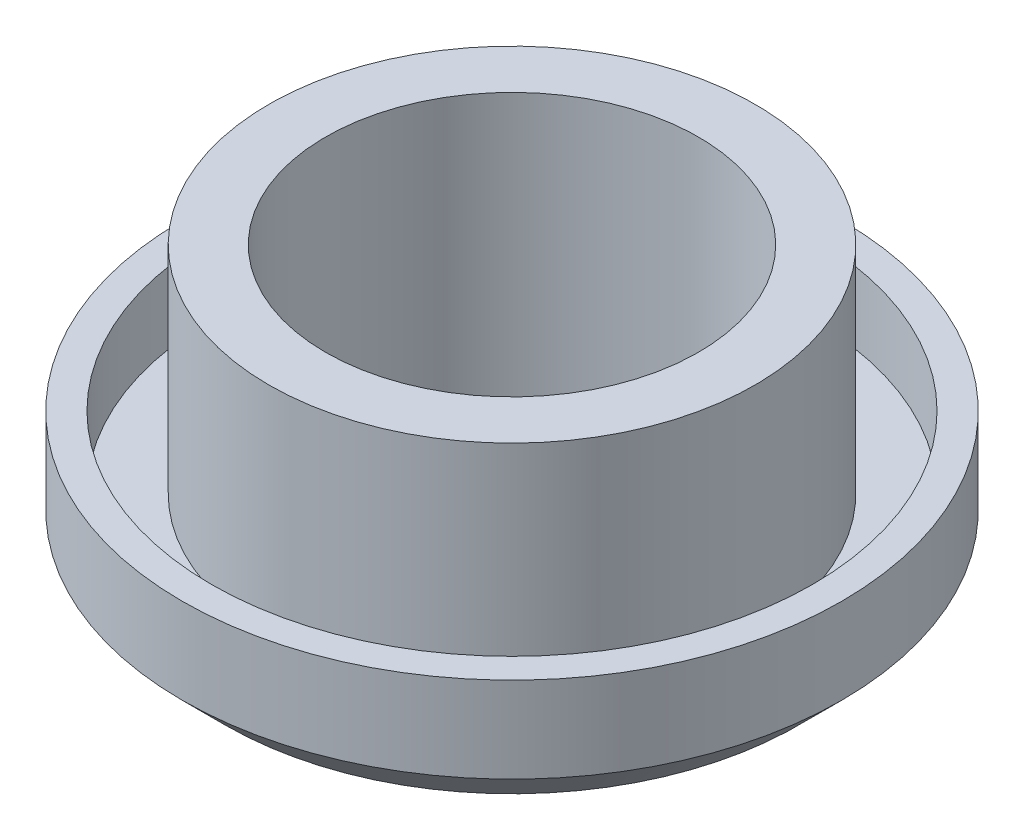
ISO-10303-21;
HEADER;
FILE_DESCRIPTION(('STEP AP214'),'2;1');
FILE_NAME('part.step','',(''),(''),'','','');
FILE_SCHEMA(('AUTOMOTIVE_DESIGN { 1 0 10303 214 1 1 1 1 }'));
ENDSEC;
DATA;
#1=APPLICATION_CONTEXT('core data for automotive mechanical design processes');
#2=APPLICATION_PROTOCOL_DEFINITION('international standard','automotive_design',2000,#1);
#3=PRODUCT_CONTEXT('',#1,'mechanical');
#4=PRODUCT('Part','Part','',(#3));
#5=PRODUCT_RELATED_PRODUCT_CATEGORY('part','',(#4));
#6=PRODUCT_DEFINITION_FORMATION('','',#4);
#7=PRODUCT_DEFINITION_CONTEXT('part definition',#1,'design');
#8=PRODUCT_DEFINITION('design','',#6,#7);
#9=PRODUCT_DEFINITION_SHAPE('','',#8);
#10=(LENGTH_UNIT() NAMED_UNIT(*) SI_UNIT(.MILLI.,.METRE.));
#11=(NAMED_UNIT(*) PLANE_ANGLE_UNIT() SI_UNIT($,.RADIAN.));
#12=(NAMED_UNIT(*) SI_UNIT($,.STERADIAN.) SOLID_ANGLE_UNIT());
#13=UNCERTAINTY_MEASURE_WITH_UNIT(LENGTH_MEASURE(1.E-05),#10,'distance_accuracy_value','');
#14=(GEOMETRIC_REPRESENTATION_CONTEXT(3) GLOBAL_UNCERTAINTY_ASSIGNED_CONTEXT((#13)) GLOBAL_UNIT_ASSIGNED_CONTEXT((#10,
#11,#12)) REPRESENTATION_CONTEXT('',''));
#15=CARTESIAN_POINT('',(0.,0.,0.));
#16=DIRECTION('',(0.,0.,1.));
#17=DIRECTION('',(1.,0.,0.));
#18=AXIS2_PLACEMENT_3D('',#15,#16,#17);
#19=CARTESIAN_POINT('',(0.,17.3,0.));
#20=DIRECTION('',(0.,-1.,0.));
#21=DIRECTION('',(0.,0.,-1.));
#22=AXIS2_PLACEMENT_3D('',#19,#20,#21);
#23=PLANE('',#22);
#24=CARTESIAN_POINT('',(17.6027715398199,17.3,0.));
#25=DIRECTION('',(0.,1.,0.));
#26=DIRECTION('',(0.,0.,1.));
#27=AXIS2_PLACEMENT_3D('',#24,#25,#26);
#28=CIRCLE('',#27,22.4);
#29=CARTESIAN_POINT('',(17.6027715398199,17.3,22.4));
#30=VERTEX_POINT('',#29);
#31=EDGE_CURVE('E79',#30,#30,#28,.T.);
#32=ORIENTED_EDGE('',*,*,#31,.F.);
#33=EDGE_LOOP('',(#32));
#34=FACE_BOUND('',#33,.T.);
#35=CARTESIAN_POINT('',(17.6027715398199,17.3,0.));
#36=DIRECTION('',(0.,1.,0.));
#37=DIRECTION('',(0.,0.,1.));
#38=AXIS2_PLACEMENT_3D('',#35,#36,#37);
#39=CIRCLE('',#38,29.2);
#40=CARTESIAN_POINT('',(17.6027715398199,17.3,29.2));
#41=VERTEX_POINT('',#40);
#42=EDGE_CURVE('E52',#41,#41,#39,.T.);
#43=ORIENTED_EDGE('',*,*,#42,.T.);
#44=EDGE_LOOP('',(#43));
#45=FACE_BOUND('',#44,.T.);
#46=ADVANCED_FACE('F39',(#34,#45),#23,.F.);
#47=CARTESIAN_POINT('',(17.6027715398199,25.4720277784783,0.));
#48=DIRECTION('',(0.,1.,0.));
#49=DIRECTION('',(0.,0.,1.));
#50=AXIS2_PLACEMENT_3D('',#47,#48,#49);
#51=CYLINDRICAL_SURFACE('',#50,29.2);
#52=ORIENTED_EDGE('',*,*,#42,.F.);
#53=EDGE_LOOP('',(#52));
#54=FACE_BOUND('',#53,.T.);
#55=CARTESIAN_POINT('',(17.6027715398199,-8.6,0.));
#56=DIRECTION('',(0.,1.,0.));
#57=DIRECTION('',(0.,0.,1.));
#58=AXIS2_PLACEMENT_3D('',#55,#56,#57);
#59=CIRCLE('',#58,29.2);
#60=CARTESIAN_POINT('',(17.6027715398199,-8.6,29.2));
#61=VERTEX_POINT('',#60);
#62=EDGE_CURVE('E57',#61,#61,#59,.T.);
#63=ORIENTED_EDGE('',*,*,#62,.T.);
#64=EDGE_LOOP('',(#63));
#65=FACE_BOUND('',#64,.T.);
#66=ADVANCED_FACE('F88',(#54,#65),#51,.T.);
#67=CARTESIAN_POINT('',(0.,-8.6,0.));
#68=DIRECTION('',(0.,-1.,0.));
#69=DIRECTION('',(0.,0.,-1.));
#70=AXIS2_PLACEMENT_3D('',#67,#68,#69);
#71=PLANE('',#70);
#72=ORIENTED_EDGE('',*,*,#62,.F.);
#73=EDGE_LOOP('',(#72));
#74=FACE_BOUND('',#73,.T.);
#75=CARTESIAN_POINT('',(17.6027715398199,-8.6,0.));
#76=DIRECTION('',(0.,1.,0.));
#77=DIRECTION('',(0.,0.,1.));
#78=AXIS2_PLACEMENT_3D('',#75,#76,#77);
#79=CIRCLE('',#78,36.1);
#80=CARTESIAN_POINT('',(17.6027715398199,-8.6,36.1));
#81=VERTEX_POINT('',#80);
#82=EDGE_CURVE('E63',#81,#81,#79,.T.);
#83=ORIENTED_EDGE('',*,*,#82,.T.);
#84=EDGE_LOOP('',(#83));
#85=FACE_BOUND('',#84,.T.);
#86=ADVANCED_FACE('F93',(#74,#85),#71,.F.);
#87=CARTESIAN_POINT('',(17.6027715398199,25.4720277784783,0.));
#88=DIRECTION('',(0.,1.,0.));
#89=DIRECTION('',(0.,0.,1.));
#90=AXIS2_PLACEMENT_3D('',#87,#88,#89);
#91=CYLINDRICAL_SURFACE('',#90,36.1);
#92=ORIENTED_EDGE('',*,*,#82,.F.);
#93=EDGE_LOOP('',(#92));
#94=FACE_BOUND('',#93,.T.);
#95=CARTESIAN_POINT('',(17.6027715398199,0.,0.));
#96=DIRECTION('',(0.,1.,0.));
#97=DIRECTION('',(0.,0.,1.));
#98=AXIS2_PLACEMENT_3D('',#95,#96,#97);
#99=CIRCLE('',#98,36.1);
#100=CARTESIAN_POINT('',(17.6027715398199,0.,36.1));
#101=VERTEX_POINT('',#100);
#102=EDGE_CURVE('E67',#101,#101,#99,.T.);
#103=ORIENTED_EDGE('',*,*,#102,.T.);
#104=EDGE_LOOP('',(#103));
#105=FACE_BOUND('',#104,.T.);
#106=ADVANCED_FACE('F99',(#94,#105),#91,.F.);
#107=CARTESIAN_POINT('',(0.,0.,0.));
#108=DIRECTION('',(0.,-1.,0.));
#109=DIRECTION('',(0.,0.,-1.));
#110=AXIS2_PLACEMENT_3D('',#107,#108,#109);
#111=PLANE('',#110);
#112=ORIENTED_EDGE('',*,*,#102,.F.);
#113=EDGE_LOOP('',(#112));
#114=FACE_BOUND('',#113,.T.);
#115=CARTESIAN_POINT('',(17.6027715398199,0.,0.));
#116=DIRECTION('',(0.,1.,0.));
#117=DIRECTION('',(0.,0.,1.));
#118=AXIS2_PLACEMENT_3D('',#115,#116,#117);
#119=CIRCLE('',#118,39.6);
#120=CARTESIAN_POINT('',(17.6027715398199,0.,39.6));
#121=VERTEX_POINT('',#120);
#122=EDGE_CURVE('E71',#121,#121,#119,.T.);
#123=ORIENTED_EDGE('',*,*,#122,.T.);
#124=EDGE_LOOP('',(#123));
#125=FACE_BOUND('',#124,.T.);
#126=ADVANCED_FACE('F105',(#114,#125),#111,.F.);
#127=CARTESIAN_POINT('',(17.6027715398199,25.4720277784783,0.));
#128=DIRECTION('',(0.,1.,0.));
#129=DIRECTION('',(0.,0.,1.));
#130=AXIS2_PLACEMENT_3D('',#127,#128,#129);
#131=CYLINDRICAL_SURFACE('',#130,39.6);
#132=CARTESIAN_POINT('',(17.6027715398199,-10.3,0.));
#133=DIRECTION('',(0.,1.,0.));
#134=DIRECTION('',(0.,0.,1.));
#135=AXIS2_PLACEMENT_3D('',#132,#133,#134);
#136=CIRCLE('',#135,39.6);
#137=CARTESIAN_POINT('',(17.6027715398199,-10.3,39.6));
#138=VERTEX_POINT('',#137);
#139=EDGE_CURVE('E47',#138,#138,#136,.T.);
#140=ORIENTED_EDGE('',*,*,#139,.T.);
#141=EDGE_LOOP('',(#140));
#142=FACE_BOUND('',#141,.T.);
#143=ORIENTED_EDGE('',*,*,#122,.F.);
#144=EDGE_LOOP('',(#143));
#145=FACE_BOUND('',#144,.T.);
#146=ADVANCED_FACE('F111',(#142,#145),#131,.T.);
#147=CARTESIAN_POINT('',(0.,-15.5,0.));
#148=DIRECTION('',(0.,1.,0.));
#149=DIRECTION('',(0.,0.,1.));
#150=AXIS2_PLACEMENT_3D('',#147,#148,#149);
#151=PLANE('',#150);
#152=CARTESIAN_POINT('',(17.6027715398199,-15.5,0.));
#153=DIRECTION('',(0.,1.,0.));
#154=DIRECTION('',(0.,0.,1.));
#155=AXIS2_PLACEMENT_3D('',#152,#153,#154);
#156=CIRCLE('',#155,34.4);
#157=CARTESIAN_POINT('',(17.6027715398199,-15.5,34.4));
#158=VERTEX_POINT('',#157);
#159=EDGE_CURVE('E10',#158,#158,#156,.F.);
#160=ORIENTED_EDGE('',*,*,#159,.T.);
#161=EDGE_LOOP('',(#160));
#162=FACE_BOUND('',#161,.T.);
#163=CARTESIAN_POINT('',(17.6027715398199,-15.5,0.));
#164=DIRECTION('',(0.,1.,0.));
#165=DIRECTION('',(0.,0.,1.));
#166=AXIS2_PLACEMENT_3D('',#163,#164,#165);
#167=CIRCLE('',#166,22.4);
#168=CARTESIAN_POINT('',(17.6027715398199,-15.5,22.4));
#169=VERTEX_POINT('',#168);
#170=EDGE_CURVE('E75',#169,#169,#167,.T.);
#171=ORIENTED_EDGE('',*,*,#170,.T.);
#172=EDGE_LOOP('',(#171));
#173=FACE_BOUND('',#172,.T.);
#174=ADVANCED_FACE('F116',(#162,#173),#151,.F.);
#175=CARTESIAN_POINT('',(17.6027715398199,25.4720277784783,0.));
#176=DIRECTION('',(0.,1.,0.));
#177=DIRECTION('',(0.,0.,1.));
#178=AXIS2_PLACEMENT_3D('',#175,#176,#177);
#179=CYLINDRICAL_SURFACE('',#178,22.4);
#180=ORIENTED_EDGE('',*,*,#170,.F.);
#181=EDGE_LOOP('',(#180));
#182=FACE_BOUND('',#181,.T.);
#183=ORIENTED_EDGE('',*,*,#31,.T.);
#184=EDGE_LOOP('',(#183));
#185=FACE_BOUND('',#184,.T.);
#186=ADVANCED_FACE('F84',(#182,#185),#179,.F.);
#187=CARTESIAN_POINT('',(17.6027715398199,-10.3,0.));
#188=DIRECTION('',(0.,1.,0.));
#189=DIRECTION('',(0.,0.,1.));
#190=AXIS2_PLACEMENT_3D('',#187,#188,#189);
#191=CONICAL_SURFACE('',#190,39.6,0.785398163397449);
#192=ORIENTED_EDGE('',*,*,#159,.F.);
#193=EDGE_LOOP('',(#192));
#194=FACE_BOUND('',#193,.T.);
#195=ORIENTED_EDGE('',*,*,#139,.F.);
#196=EDGE_LOOP('',(#195));
#197=FACE_BOUND('',#196,.T.);
#198=ADVANCED_FACE('F41',(#194,#197),#191,.T.);
#199=CLOSED_SHELL('',(#46,#66,#86,#106,#126,#146,#174,#186,#198));
#200=MANIFOLD_SOLID_BREP('B2',#199);
#201=ADVANCED_BREP_SHAPE_REPRESENTATION('',(#18,#200),#14);
#202=SHAPE_DEFINITION_REPRESENTATION(#9,#201);
ENDSEC;
END-ISO-10303-21;
